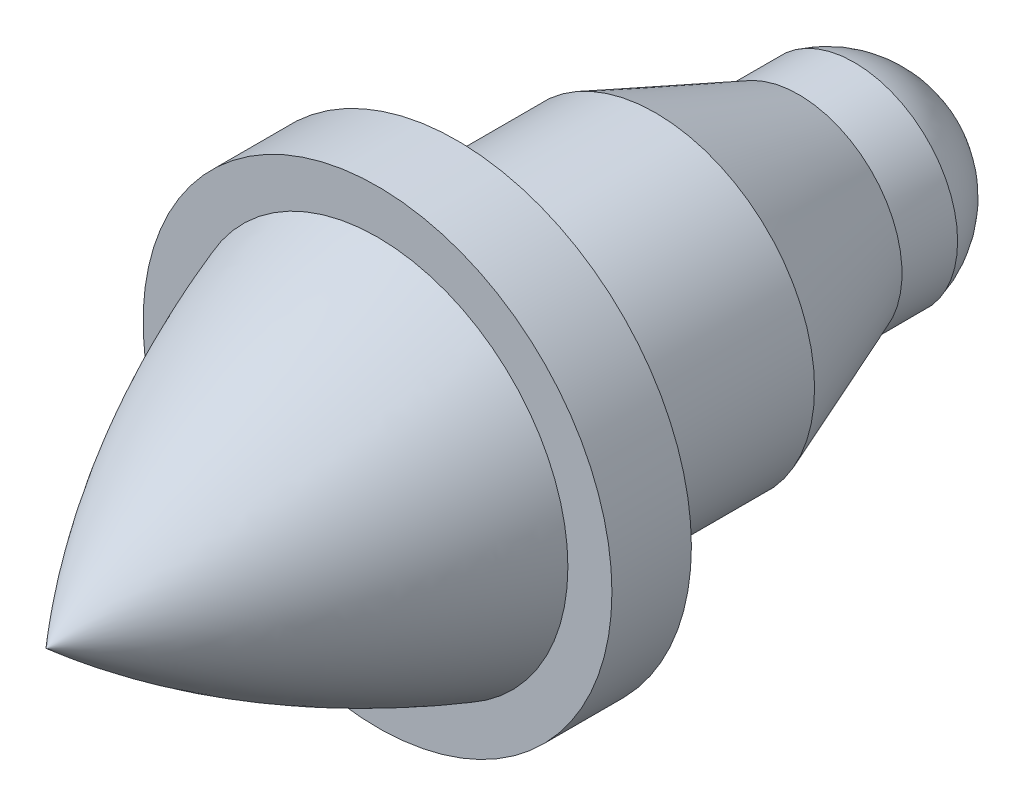
ISO-10303-21;
HEADER;
FILE_DESCRIPTION(('STEP AP214'),'2;1');
FILE_NAME('part.step','',(''),(''),'','','');
FILE_SCHEMA(('AUTOMOTIVE_DESIGN { 1 0 10303 214 1 1 1 1 }'));
ENDSEC;
DATA;
#1=APPLICATION_CONTEXT('core data for automotive mechanical design processes');
#2=APPLICATION_PROTOCOL_DEFINITION('international standard','automotive_design',2000,#1);
#3=PRODUCT_CONTEXT('',#1,'mechanical');
#4=PRODUCT('Part','Part','',(#3));
#5=PRODUCT_RELATED_PRODUCT_CATEGORY('part','',(#4));
#6=PRODUCT_DEFINITION_FORMATION('','',#4);
#7=PRODUCT_DEFINITION_CONTEXT('part definition',#1,'design');
#8=PRODUCT_DEFINITION('design','',#6,#7);
#9=PRODUCT_DEFINITION_SHAPE('','',#8);
#10=(LENGTH_UNIT() NAMED_UNIT(*) SI_UNIT(.MILLI.,.METRE.));
#11=(NAMED_UNIT(*) PLANE_ANGLE_UNIT() SI_UNIT($,.RADIAN.));
#12=(NAMED_UNIT(*) SI_UNIT($,.STERADIAN.) SOLID_ANGLE_UNIT());
#13=UNCERTAINTY_MEASURE_WITH_UNIT(LENGTH_MEASURE(1.E-05),#10,'distance_accuracy_value','');
#14=(GEOMETRIC_REPRESENTATION_CONTEXT(3) GLOBAL_UNCERTAINTY_ASSIGNED_CONTEXT((#13)) GLOBAL_UNIT_ASSIGNED_CONTEXT((#10,
#11,#12)) REPRESENTATION_CONTEXT('',''));
#15=CARTESIAN_POINT('',(0.,0.,0.));
#16=DIRECTION('',(0.,0.,1.));
#17=DIRECTION('',(1.,0.,0.));
#18=AXIS2_PLACEMENT_3D('',#15,#16,#17);
#19=CARTESIAN_POINT('',(0.,0.,17.845728077468));
#20=DIRECTION('',(0.,0.,1.));
#21=DIRECTION('',(1.,0.,0.));
#22=AXIS2_PLACEMENT_3D('',#19,#20,#21);
#23=CYLINDRICAL_SURFACE('',#22,5.08);
#24=CARTESIAN_POINT('',(0.,0.,6.31371428571429));
#25=DIRECTION('',(0.,0.,1.));
#26=DIRECTION('',(1.,0.,0.));
#27=AXIS2_PLACEMENT_3D('',#24,#25,#26);
#28=CIRCLE('',#27,5.08);
#29=CARTESIAN_POINT('',(5.08,0.,6.31371428571429));
#30=VERTEX_POINT('',#29);
#31=EDGE_CURVE('E85',#30,#30,#28,.T.);
#32=ORIENTED_EDGE('',*,*,#31,.F.);
#33=EDGE_LOOP('',(#32));
#34=FACE_BOUND('',#33,.T.);
#35=CARTESIAN_POINT('',(0.,0.,-0.0362857142857144));
#36=DIRECTION('',(0.,0.,-1.));
#37=DIRECTION('',(-1.,0.,0.));
#38=AXIS2_PLACEMENT_3D('',#35,#36,#37);
#39=CIRCLE('',#38,5.08);
#40=CARTESIAN_POINT('',(-5.08,0.,-0.0362857142857144));
#41=VERTEX_POINT('',#40);
#42=EDGE_CURVE('E118',#41,#41,#39,.T.);
#43=ORIENTED_EDGE('',*,*,#42,.F.);
#44=EDGE_LOOP('',(#43));
#45=FACE_BOUND('',#44,.T.);
#46=ADVANCED_FACE('F56',(#34,#45),#23,.T.);
#47=CARTESIAN_POINT('',(0.,0.,8.85371428571429));
#48=DIRECTION('',(0.,0.,-1.));
#49=DIRECTION('',(-1.,0.,0.));
#50=AXIS2_PLACEMENT_3D('',#47,#48,#49);
#51=PLANE('',#50);
#52=CARTESIAN_POINT('',(0.,0.,8.85371428571429));
#53=DIRECTION('',(0.,0.,1.));
#54=DIRECTION('',(1.,0.,0.));
#55=AXIS2_PLACEMENT_3D('',#52,#53,#54);
#56=CIRCLE('',#55,6.08565505940093);
#57=CARTESIAN_POINT('',(6.08565505940093,0.,8.85371428571429));
#58=VERTEX_POINT('',#57);
#59=EDGE_CURVE('E14',#58,#58,#56,.T.);
#60=ORIENTED_EDGE('',*,*,#59,.F.);
#61=EDGE_LOOP('',(#60));
#62=FACE_BOUND('',#61,.T.);
#63=CARTESIAN_POINT('',(0.,0.,8.85371428571429));
#64=DIRECTION('',(0.,0.,1.));
#65=DIRECTION('',(1.,0.,0.));
#66=AXIS2_PLACEMENT_3D('',#63,#64,#65);
#67=CIRCLE('',#66,7.493);
#68=CARTESIAN_POINT('',(7.493,0.,8.85371428571429));
#69=VERTEX_POINT('',#68);
#70=EDGE_CURVE('E64',#69,#69,#67,.T.);
#71=ORIENTED_EDGE('',*,*,#70,.T.);
#72=EDGE_LOOP('',(#71));
#73=FACE_BOUND('',#72,.T.);
#74=ADVANCED_FACE('F75',(#62,#73),#51,.F.);
#75=CARTESIAN_POINT('',(0.,0.,17.845728077468));
#76=DIRECTION('',(0.,0.,1.));
#77=DIRECTION('',(1.,0.,0.));
#78=AXIS2_PLACEMENT_3D('',#75,#76,#77);
#79=CYLINDRICAL_SURFACE('',#78,7.493);
#80=ORIENTED_EDGE('',*,*,#70,.F.);
#81=EDGE_LOOP('',(#80));
#82=FACE_BOUND('',#81,.T.);
#83=CARTESIAN_POINT('',(0.,0.,6.31371428571429));
#84=DIRECTION('',(0.,0.,1.));
#85=DIRECTION('',(1.,0.,0.));
#86=AXIS2_PLACEMENT_3D('',#83,#84,#85);
#87=CIRCLE('',#86,7.493);
#88=CARTESIAN_POINT('',(7.493,0.,6.31371428571429));
#89=VERTEX_POINT('',#88);
#90=EDGE_CURVE('E82',#89,#89,#87,.T.);
#91=ORIENTED_EDGE('',*,*,#90,.T.);
#92=EDGE_LOOP('',(#91));
#93=FACE_BOUND('',#92,.T.);
#94=ADVANCED_FACE('F78',(#82,#93),#79,.T.);
#95=CARTESIAN_POINT('',(0.,7.493,6.31371428571429));
#96=DIRECTION('',(0.,0.,1.));
#97=DIRECTION('',(1.,0.,0.));
#98=AXIS2_PLACEMENT_3D('',#95,#96,#97);
#99=PLANE('',#98);
#100=ORIENTED_EDGE('',*,*,#90,.F.);
#101=EDGE_LOOP('',(#100));
#102=FACE_BOUND('',#101,.T.);
#103=ORIENTED_EDGE('',*,*,#31,.T.);
#104=EDGE_LOOP('',(#103));
#105=FACE_BOUND('',#104,.T.);
#106=ADVANCED_FACE('F71',(#102,#105),#99,.F.);
#107=CARTESIAN_POINT('',(0.,6.08565505940093,8.85371428571429));
#108=CARTESIAN_POINT('',(0.,4.02076263292769,14.8177026589631));
#109=CARTESIAN_POINT('',(0.,0.,19.4495601729752));
#110=B_SPLINE_CURVE_WITH_KNOTS('',2,(#107,#108,#109),.UNSPECIFIED.,.F.,.F.,(3,3),(0.,1.),.UNSPECIFIED.);
#111=CARTESIAN_POINT('',(0.,0.,19.4495601729752));
#112=DIRECTION('',(0.,0.,1.));
#113=AXIS1_PLACEMENT('',#111,#112);
#114=SURFACE_OF_REVOLUTION('',#110,#113);
#115=CARTESIAN_POINT('',(0.,0.,19.4495601729752));
#116=VERTEX_POINT('',#115);
#117=VERTEX_LOOP('',#116);
#118=FACE_BOUND('',#117,.T.);
#119=ORIENTED_EDGE('',*,*,#59,.T.);
#120=EDGE_LOOP('',(#119));
#121=FACE_BOUND('',#120,.T.);
#122=ADVANCED_FACE('F67',(#118,#121),#114,.T.);
#123=CARTESIAN_POINT('',(0.,0.,-17.8989878090795));
#124=DIRECTION('',(0.,0.,-1.));
#125=DIRECTION('',(-1.,0.,0.));
#126=AXIS2_PLACEMENT_3D('',#123,#124,#125);
#127=CYLINDRICAL_SURFACE('',#126,3.302);
#128=CARTESIAN_POINT('',(0.,0.,-6.38628571428571));
#129=DIRECTION('',(0.,0.,-1.));
#130=DIRECTION('',(-1.,0.,0.));
#131=AXIS2_PLACEMENT_3D('',#128,#129,#130);
#132=CIRCLE('',#131,3.302);
#133=CARTESIAN_POINT('',(-3.302,0.,-6.38628571428571));
#134=VERTEX_POINT('',#133);
#135=EDGE_CURVE('E60',#134,#134,#132,.T.);
#136=ORIENTED_EDGE('',*,*,#135,.F.);
#137=EDGE_LOOP('',(#136));
#138=FACE_BOUND('',#137,.T.);
#139=CARTESIAN_POINT('',(0.,0.,-4.60828571428571));
#140=DIRECTION('',(0.,0.,-1.));
#141=DIRECTION('',(-1.,0.,0.));
#142=AXIS2_PLACEMENT_3D('',#139,#140,#141);
#143=CIRCLE('',#142,3.302);
#144=CARTESIAN_POINT('',(-3.302,0.,-4.60828571428571));
#145=VERTEX_POINT('',#144);
#146=EDGE_CURVE('E90',#145,#145,#143,.T.);
#147=ORIENTED_EDGE('',*,*,#146,.T.);
#148=EDGE_LOOP('',(#147));
#149=FACE_BOUND('',#148,.T.);
#150=ADVANCED_FACE('F70',(#138,#149),#127,.T.);
#151=CARTESIAN_POINT('',(0.,0.,-0.0362857142857144));
#152=DIRECTION('',(0.,0.,1.));
#153=DIRECTION('',(1.,0.,0.));
#154=AXIS2_PLACEMENT_3D('',#151,#152,#153);
#155=CONICAL_SURFACE('',#154,5.08,0.370891288812663);
#156=ORIENTED_EDGE('',*,*,#146,.F.);
#157=EDGE_LOOP('',(#156));
#158=FACE_BOUND('',#157,.T.);
#159=ORIENTED_EDGE('',*,*,#42,.T.);
#160=EDGE_LOOP('',(#159));
#161=FACE_BOUND('',#160,.T.);
#162=ADVANCED_FACE('F127',(#158,#161),#155,.T.);
#163=CARTESIAN_POINT('',(0.,0.,-5.50998571428572));
#164=DIRECTION('',(0.,0.,1.));
#165=DIRECTION('',(1.,0.,0.));
#166=AXIS2_PLACEMENT_3D('',#163,#164,#165);
#167=SPHERICAL_SURFACE('',#166,3.4163);
#168=ORIENTED_EDGE('',*,*,#135,.T.);
#169=EDGE_LOOP('',(#168));
#170=FACE_BOUND('',#169,.T.);
#171=ADVANCED_FACE('F58',(#170),#167,.T.);
#172=CLOSED_SHELL('',(#46,#74,#94,#106,#122,#150,#162,#171));
#173=MANIFOLD_SOLID_BREP('B2',#172);
#174=ADVANCED_BREP_SHAPE_REPRESENTATION('',(#18,#173),#14);
#175=SHAPE_DEFINITION_REPRESENTATION(#9,#174);
ENDSEC;
END-ISO-10303-21;
